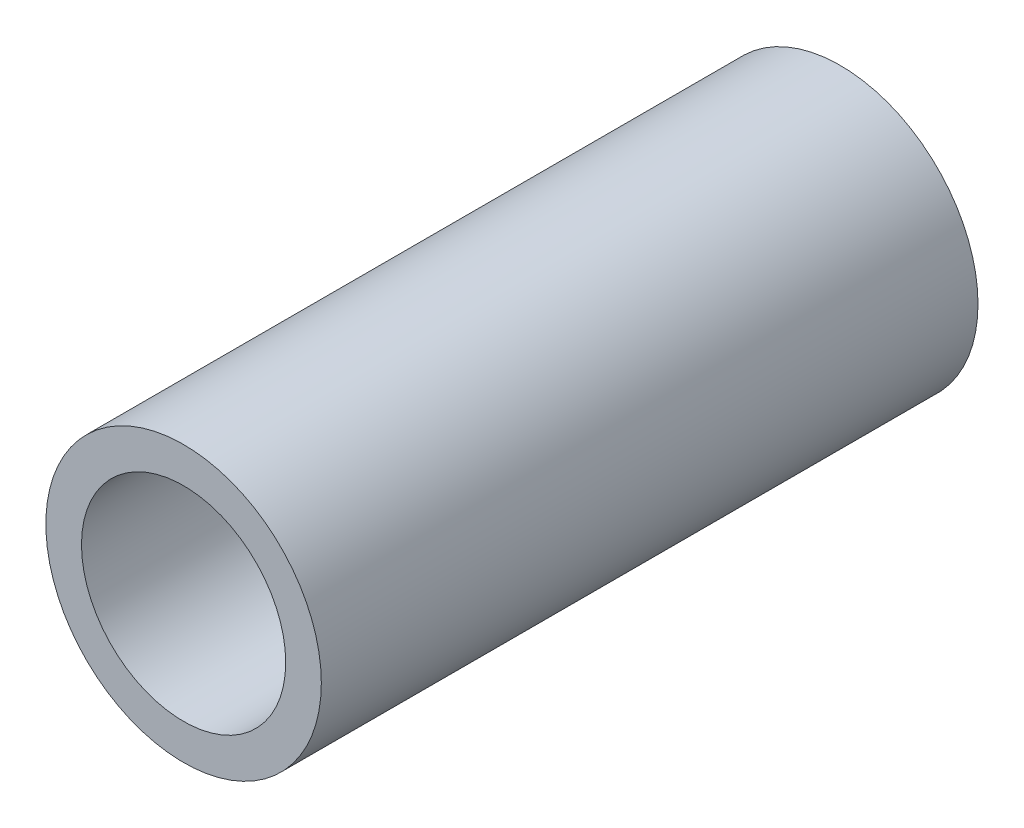
ISO-10303-21;
HEADER;
FILE_DESCRIPTION(('STEP AP214'),'2;1');
FILE_NAME('part.step','',(''),(''),'','','');
FILE_SCHEMA(('AUTOMOTIVE_DESIGN { 1 0 10303 214 1 1 1 1 }'));
ENDSEC;
DATA;
#1=APPLICATION_CONTEXT('core data for automotive mechanical design processes');
#2=APPLICATION_PROTOCOL_DEFINITION('international standard','automotive_design',2000,#1);
#3=PRODUCT_CONTEXT('',#1,'mechanical');
#4=PRODUCT('Part','Part','',(#3));
#5=PRODUCT_RELATED_PRODUCT_CATEGORY('part','',(#4));
#6=PRODUCT_DEFINITION_FORMATION('','',#4);
#7=PRODUCT_DEFINITION_CONTEXT('part definition',#1,'design');
#8=PRODUCT_DEFINITION('design','',#6,#7);
#9=PRODUCT_DEFINITION_SHAPE('','',#8);
#10=(LENGTH_UNIT() NAMED_UNIT(*) SI_UNIT(.MILLI.,.METRE.));
#11=(NAMED_UNIT(*) PLANE_ANGLE_UNIT() SI_UNIT($,.RADIAN.));
#12=(NAMED_UNIT(*) SI_UNIT($,.STERADIAN.) SOLID_ANGLE_UNIT());
#13=UNCERTAINTY_MEASURE_WITH_UNIT(LENGTH_MEASURE(1.E-05),#10,'distance_accuracy_value','');
#14=(GEOMETRIC_REPRESENTATION_CONTEXT(3) GLOBAL_UNCERTAINTY_ASSIGNED_CONTEXT((#13)) GLOBAL_UNIT_ASSIGNED_CONTEXT((#10,
#11,#12)) REPRESENTATION_CONTEXT('',''));
#15=CARTESIAN_POINT('',(0.,0.,0.));
#16=DIRECTION('',(0.,0.,1.));
#17=DIRECTION('',(1.,0.,0.));
#18=AXIS2_PLACEMENT_3D('',#15,#16,#17);
#19=CARTESIAN_POINT('',(0.,0.,50.8));
#20=DIRECTION('',(0.,0.,1.));
#21=DIRECTION('',(1.,0.,0.));
#22=AXIS2_PLACEMENT_3D('',#19,#20,#21);
#23=PLANE('',#22);
#24=CARTESIAN_POINT('',(0.,0.,50.8));
#25=DIRECTION('',(0.,0.,1.));
#26=DIRECTION('',(1.,0.,0.));
#27=AXIS2_PLACEMENT_3D('',#24,#25,#26);
#28=CIRCLE('',#27,10.6553);
#29=CARTESIAN_POINT('',(10.6553,0.,50.8));
#30=VERTEX_POINT('',#29);
#31=EDGE_CURVE('E10',#30,#30,#28,.T.);
#32=ORIENTED_EDGE('',*,*,#31,.T.);
#33=EDGE_LOOP('',(#32));
#34=FACE_BOUND('',#33,.T.);
#35=CARTESIAN_POINT('',(0.,0.,50.8));
#36=DIRECTION('',(0.,0.,1.));
#37=DIRECTION('',(1.,0.,0.));
#38=AXIS2_PLACEMENT_3D('',#35,#36,#37);
#39=CIRCLE('',#38,7.8994);
#40=CARTESIAN_POINT('',(7.8994,0.,50.8));
#41=VERTEX_POINT('',#40);
#42=EDGE_CURVE('E42',#41,#41,#39,.T.);
#43=ORIENTED_EDGE('',*,*,#42,.F.);
#44=EDGE_LOOP('',(#43));
#45=FACE_BOUND('',#44,.T.);
#46=ADVANCED_FACE('F31',(#34,#45),#23,.T.);
#47=CARTESIAN_POINT('',(0.,0.,0.));
#48=DIRECTION('',(0.,0.,1.));
#49=DIRECTION('',(1.,0.,0.));
#50=AXIS2_PLACEMENT_3D('',#47,#48,#49);
#51=PLANE('',#50);
#52=CARTESIAN_POINT('',(0.,0.,0.));
#53=DIRECTION('',(0.,0.,1.));
#54=DIRECTION('',(1.,0.,0.));
#55=AXIS2_PLACEMENT_3D('',#52,#53,#54);
#56=CIRCLE('',#55,10.6553);
#57=CARTESIAN_POINT('',(10.6553,0.,0.));
#58=VERTEX_POINT('',#57);
#59=EDGE_CURVE('E35',#58,#58,#56,.T.);
#60=ORIENTED_EDGE('',*,*,#59,.F.);
#61=EDGE_LOOP('',(#60));
#62=FACE_BOUND('',#61,.T.);
#63=CARTESIAN_POINT('',(0.,0.,0.));
#64=DIRECTION('',(0.,0.,1.));
#65=DIRECTION('',(1.,0.,0.));
#66=AXIS2_PLACEMENT_3D('',#63,#64,#65);
#67=CIRCLE('',#66,7.8994);
#68=CARTESIAN_POINT('',(7.8994,0.,0.));
#69=VERTEX_POINT('',#68);
#70=EDGE_CURVE('E44',#69,#69,#67,.T.);
#71=ORIENTED_EDGE('',*,*,#70,.T.);
#72=EDGE_LOOP('',(#71));
#73=FACE_BOUND('',#72,.T.);
#74=ADVANCED_FACE('F54',(#62,#73),#51,.F.);
#75=CARTESIAN_POINT('',(0.,0.,50.8));
#76=DIRECTION('',(0.,0.,-1.));
#77=DIRECTION('',(-1.,0.,0.));
#78=AXIS2_PLACEMENT_3D('',#75,#76,#77);
#79=CYLINDRICAL_SURFACE('',#78,10.6553);
#80=ORIENTED_EDGE('',*,*,#31,.F.);
#81=EDGE_LOOP('',(#80));
#82=FACE_BOUND('',#81,.T.);
#83=ORIENTED_EDGE('',*,*,#59,.T.);
#84=EDGE_LOOP('',(#83));
#85=FACE_BOUND('',#84,.T.);
#86=ADVANCED_FACE('F33',(#82,#85),#79,.T.);
#87=CARTESIAN_POINT('',(0.,0.,50.8));
#88=DIRECTION('',(0.,0.,-1.));
#89=DIRECTION('',(-1.,0.,0.));
#90=AXIS2_PLACEMENT_3D('',#87,#88,#89);
#91=CYLINDRICAL_SURFACE('',#90,7.8994);
#92=ORIENTED_EDGE('',*,*,#42,.T.);
#93=EDGE_LOOP('',(#92));
#94=FACE_BOUND('',#93,.T.);
#95=ORIENTED_EDGE('',*,*,#70,.F.);
#96=EDGE_LOOP('',(#95));
#97=FACE_BOUND('',#96,.T.);
#98=ADVANCED_FACE('F50',(#94,#97),#91,.F.);
#99=CLOSED_SHELL('',(#46,#74,#86,#98));
#100=MANIFOLD_SOLID_BREP('B2',#99);
#101=ADVANCED_BREP_SHAPE_REPRESENTATION('',(#18,#100),#14);
#102=SHAPE_DEFINITION_REPRESENTATION(#9,#101);
ENDSEC;
END-ISO-10303-21;
